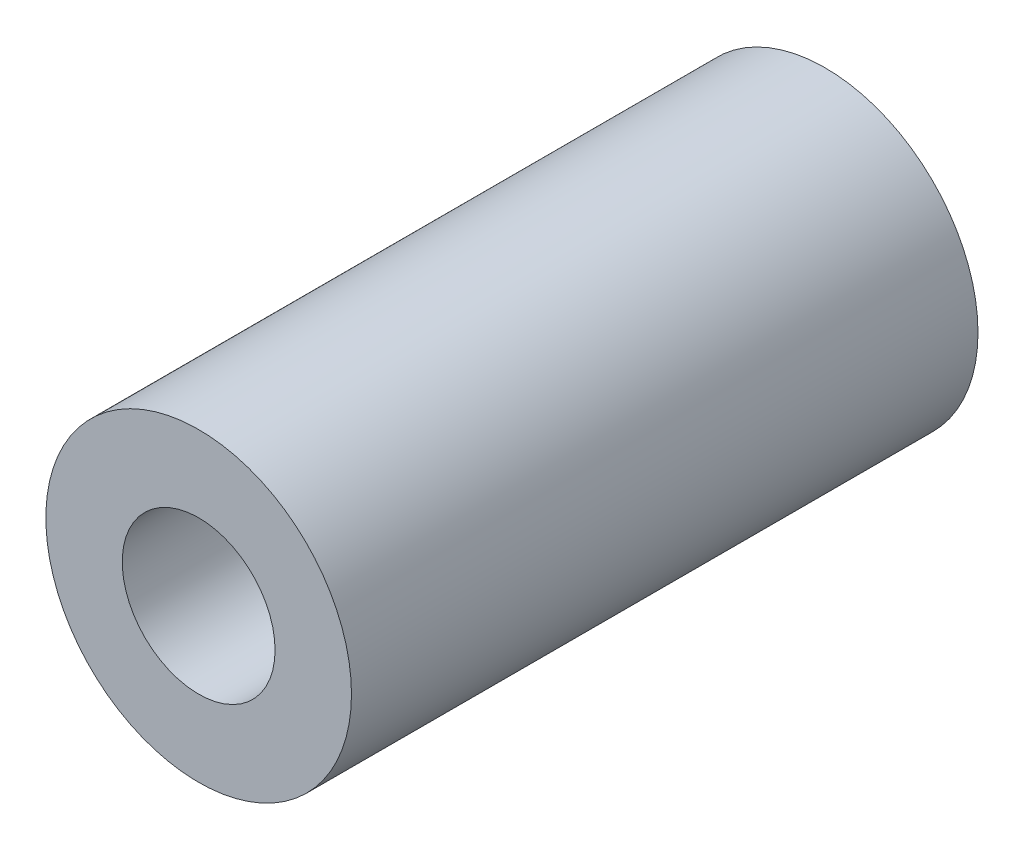
ISO-10303-21;
HEADER;
FILE_DESCRIPTION(('STEP AP214'),'2;1');
FILE_NAME('part.step','',(''),(''),'','','');
FILE_SCHEMA(('AUTOMOTIVE_DESIGN { 1 0 10303 214 1 1 1 1 }'));
ENDSEC;
DATA;
#1=APPLICATION_CONTEXT('core data for automotive mechanical design processes');
#2=APPLICATION_PROTOCOL_DEFINITION('international standard','automotive_design',2000,#1);
#3=PRODUCT_CONTEXT('',#1,'mechanical');
#4=PRODUCT('Part','Part','',(#3));
#5=PRODUCT_RELATED_PRODUCT_CATEGORY('part','',(#4));
#6=PRODUCT_DEFINITION_FORMATION('','',#4);
#7=PRODUCT_DEFINITION_CONTEXT('part definition',#1,'design');
#8=PRODUCT_DEFINITION('design','',#6,#7);
#9=PRODUCT_DEFINITION_SHAPE('','',#8);
#10=(LENGTH_UNIT() NAMED_UNIT(*) SI_UNIT(.MILLI.,.METRE.));
#11=(NAMED_UNIT(*) PLANE_ANGLE_UNIT() SI_UNIT($,.RADIAN.));
#12=(NAMED_UNIT(*) SI_UNIT($,.STERADIAN.) SOLID_ANGLE_UNIT());
#13=UNCERTAINTY_MEASURE_WITH_UNIT(LENGTH_MEASURE(1.E-05),#10,'distance_accuracy_value','');
#14=(GEOMETRIC_REPRESENTATION_CONTEXT(3) GLOBAL_UNCERTAINTY_ASSIGNED_CONTEXT((#13)) GLOBAL_UNIT_ASSIGNED_CONTEXT((#10,
#11,#12)) REPRESENTATION_CONTEXT('',''));
#15=CARTESIAN_POINT('',(0.,0.,0.));
#16=DIRECTION('',(0.,0.,1.));
#17=DIRECTION('',(1.,0.,0.));
#18=AXIS2_PLACEMENT_3D('',#15,#16,#17);
#19=CARTESIAN_POINT('',(0.,0.,41.));
#20=DIRECTION('',(0.,0.,1.));
#21=DIRECTION('',(1.,0.,0.));
#22=AXIS2_PLACEMENT_3D('',#19,#20,#21);
#23=PLANE('',#22);
#24=CARTESIAN_POINT('',(0.,0.,41.));
#25=DIRECTION('',(0.,0.,1.));
#26=DIRECTION('',(1.,0.,0.));
#27=AXIS2_PLACEMENT_3D('',#24,#25,#26);
#28=CIRCLE('',#27,10.);
#29=CARTESIAN_POINT('',(10.,0.,41.));
#30=VERTEX_POINT('',#29);
#31=EDGE_CURVE('E10',#30,#30,#28,.T.);
#32=ORIENTED_EDGE('',*,*,#31,.T.);
#33=EDGE_LOOP('',(#32));
#34=FACE_BOUND('',#33,.T.);
#35=CARTESIAN_POINT('',(0.,0.,41.));
#36=DIRECTION('',(0.,0.,1.));
#37=DIRECTION('',(1.,0.,0.));
#38=AXIS2_PLACEMENT_3D('',#35,#36,#37);
#39=CIRCLE('',#38,5.);
#40=CARTESIAN_POINT('',(5.,0.,41.));
#41=VERTEX_POINT('',#40);
#42=EDGE_CURVE('E44',#41,#41,#39,.T.);
#43=ORIENTED_EDGE('',*,*,#42,.F.);
#44=EDGE_LOOP('',(#43));
#45=FACE_BOUND('',#44,.T.);
#46=ADVANCED_FACE('F33',(#34,#45),#23,.T.);
#47=CARTESIAN_POINT('',(0.,0.,0.));
#48=DIRECTION('',(0.,0.,1.));
#49=DIRECTION('',(1.,0.,0.));
#50=AXIS2_PLACEMENT_3D('',#47,#48,#49);
#51=PLANE('',#50);
#52=CARTESIAN_POINT('',(0.,0.,0.));
#53=DIRECTION('',(0.,0.,1.));
#54=DIRECTION('',(1.,0.,0.));
#55=AXIS2_PLACEMENT_3D('',#52,#53,#54);
#56=CIRCLE('',#55,10.);
#57=CARTESIAN_POINT('',(10.,0.,0.));
#58=VERTEX_POINT('',#57);
#59=EDGE_CURVE('E37',#58,#58,#56,.T.);
#60=ORIENTED_EDGE('',*,*,#59,.F.);
#61=EDGE_LOOP('',(#60));
#62=FACE_BOUND('',#61,.T.);
#63=CARTESIAN_POINT('',(0.,0.,0.));
#64=DIRECTION('',(0.,0.,1.));
#65=DIRECTION('',(1.,0.,0.));
#66=AXIS2_PLACEMENT_3D('',#63,#64,#65);
#67=CIRCLE('',#66,5.);
#68=CARTESIAN_POINT('',(5.,0.,0.));
#69=VERTEX_POINT('',#68);
#70=EDGE_CURVE('E46',#69,#69,#67,.T.);
#71=ORIENTED_EDGE('',*,*,#70,.T.);
#72=EDGE_LOOP('',(#71));
#73=FACE_BOUND('',#72,.T.);
#74=ADVANCED_FACE('F56',(#62,#73),#51,.F.);
#75=CARTESIAN_POINT('',(0.,0.,41.));
#76=DIRECTION('',(0.,0.,-1.));
#77=DIRECTION('',(-1.,0.,0.));
#78=AXIS2_PLACEMENT_3D('',#75,#76,#77);
#79=CYLINDRICAL_SURFACE('',#78,10.);
#80=ORIENTED_EDGE('',*,*,#31,.F.);
#81=EDGE_LOOP('',(#80));
#82=FACE_BOUND('',#81,.T.);
#83=ORIENTED_EDGE('',*,*,#59,.T.);
#84=EDGE_LOOP('',(#83));
#85=FACE_BOUND('',#84,.T.);
#86=ADVANCED_FACE('F35',(#82,#85),#79,.T.);
#87=CARTESIAN_POINT('',(0.,0.,41.));
#88=DIRECTION('',(0.,0.,-1.));
#89=DIRECTION('',(-1.,0.,0.));
#90=AXIS2_PLACEMENT_3D('',#87,#88,#89);
#91=CYLINDRICAL_SURFACE('',#90,5.);
#92=ORIENTED_EDGE('',*,*,#42,.T.);
#93=EDGE_LOOP('',(#92));
#94=FACE_BOUND('',#93,.T.);
#95=ORIENTED_EDGE('',*,*,#70,.F.);
#96=EDGE_LOOP('',(#95));
#97=FACE_BOUND('',#96,.T.);
#98=ADVANCED_FACE('F52',(#94,#97),#91,.F.);
#99=CLOSED_SHELL('',(#46,#74,#86,#98));
#100=MANIFOLD_SOLID_BREP('B2',#99);
#101=ADVANCED_BREP_SHAPE_REPRESENTATION('',(#18,#100),#14);
#102=SHAPE_DEFINITION_REPRESENTATION(#9,#101);
ENDSEC;
END-ISO-10303-21;
